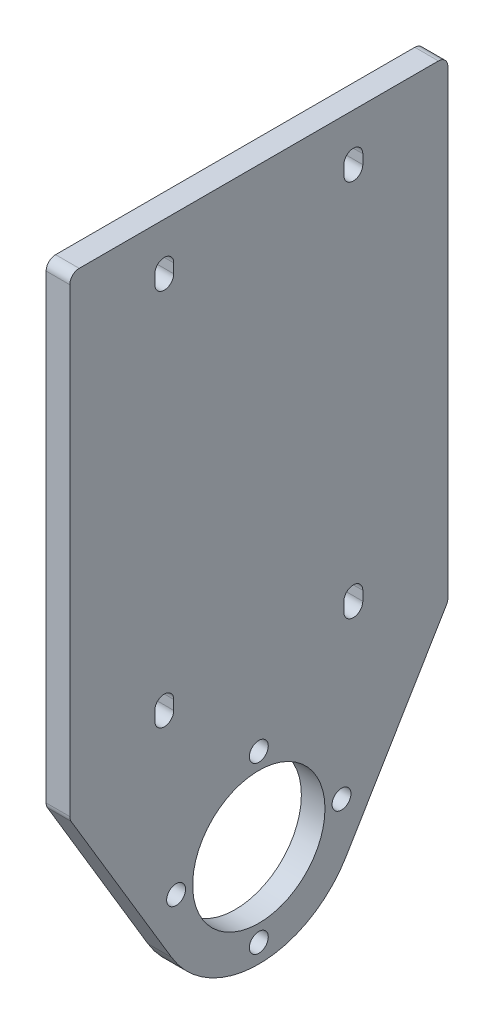
ISO-10303-21;
HEADER;
FILE_DESCRIPTION(('STEP AP214'),'2;1');
FILE_NAME('part.step','',(''),(''),'','','');
FILE_SCHEMA(('AUTOMOTIVE_DESIGN { 1 0 10303 214 1 1 1 1 }'));
ENDSEC;
DATA;
#1=APPLICATION_CONTEXT('core data for automotive mechanical design processes');
#2=APPLICATION_PROTOCOL_DEFINITION('international standard','automotive_design',2000,#1);
#3=PRODUCT_CONTEXT('',#1,'mechanical');
#4=PRODUCT('Part','Part','',(#3));
#5=PRODUCT_RELATED_PRODUCT_CATEGORY('part','',(#4));
#6=PRODUCT_DEFINITION_FORMATION('','',#4);
#7=PRODUCT_DEFINITION_CONTEXT('part definition',#1,'design');
#8=PRODUCT_DEFINITION('design','',#6,#7);
#9=PRODUCT_DEFINITION_SHAPE('','',#8);
#10=(LENGTH_UNIT() NAMED_UNIT(*) SI_UNIT(.MILLI.,.METRE.));
#11=(NAMED_UNIT(*) PLANE_ANGLE_UNIT() SI_UNIT($,.RADIAN.));
#12=(NAMED_UNIT(*) SI_UNIT($,.STERADIAN.) SOLID_ANGLE_UNIT());
#13=UNCERTAINTY_MEASURE_WITH_UNIT(LENGTH_MEASURE(1.E-05),#10,'distance_accuracy_value','');
#14=(GEOMETRIC_REPRESENTATION_CONTEXT(3) GLOBAL_UNCERTAINTY_ASSIGNED_CONTEXT((#13)) GLOBAL_UNIT_ASSIGNED_CONTEXT((#10,
#11,#12)) REPRESENTATION_CONTEXT('',''));
#15=CARTESIAN_POINT('',(0.,0.,0.));
#16=DIRECTION('',(0.,0.,1.));
#17=DIRECTION('',(1.,0.,0.));
#18=AXIS2_PLACEMENT_3D('',#15,#16,#17);
#19=CARTESIAN_POINT('',(5.,0.,21.9999999999999));
#20=DIRECTION('',(0.,0.,1.));
#21=DIRECTION('',(0.,-1.,0.));
#22=AXIS2_PLACEMENT_3D('',#19,#20,#21);
#23=PLANE('',#22);
#24=DIRECTION('',(0.,1.,0.));
#25=VECTOR('',#24,1.);
#26=CARTESIAN_POINT('',(0.,0.,21.9999999999999));
#27=LINE('',#26,#25);
#28=CARTESIAN_POINT('',(0.,-41.,22.));
#29=VERTEX_POINT('',#28);
#30=CARTESIAN_POINT('',(0.,-39.,22.));
#31=VERTEX_POINT('',#30);
#32=EDGE_CURVE('E414',#29,#31,#27,.T.);
#33=ORIENTED_EDGE('',*,*,#32,.T.);
#34=DIRECTION('',(-1.,0.,0.));
#35=VECTOR('',#34,1.);
#36=CARTESIAN_POINT('',(5.,-39.,22.));
#37=LINE('',#36,#35);
#38=CARTESIAN_POINT('',(5.,-39.,22.));
#39=VERTEX_POINT('',#38);
#40=EDGE_CURVE('E447',#39,#31,#37,.T.);
#41=ORIENTED_EDGE('',*,*,#40,.F.);
#42=DIRECTION('',(0.,1.,0.));
#43=VECTOR('',#42,1.);
#44=CARTESIAN_POINT('',(5.,0.,21.9999999999999));
#45=LINE('',#44,#43);
#46=CARTESIAN_POINT('',(5.,-41.,22.));
#47=VERTEX_POINT('',#46);
#48=EDGE_CURVE('E332',#47,#39,#45,.T.);
#49=ORIENTED_EDGE('',*,*,#48,.F.);
#50=DIRECTION('',(-1.,0.,0.));
#51=VECTOR('',#50,1.);
#52=CARTESIAN_POINT('',(5.,-41.,22.));
#53=LINE('',#52,#51);
#54=EDGE_CURVE('E439',#47,#29,#53,.T.);
#55=ORIENTED_EDGE('',*,*,#54,.T.);
#56=EDGE_LOOP('',(#33,#41,#49,#55));
#57=FACE_BOUND('',#56,.T.);
#58=ADVANCED_FACE('F41',(#57),#23,.F.);
#59=CARTESIAN_POINT('',(5.,-39.,20.));
#60=DIRECTION('',(-1.,0.,0.));
#61=DIRECTION('',(0.,0.,1.));
#62=AXIS2_PLACEMENT_3D('',#59,#60,#61);
#63=CYLINDRICAL_SURFACE('',#62,2.);
#64=CARTESIAN_POINT('',(0.,-39.,20.));
#65=DIRECTION('',(1.,0.,0.));
#66=DIRECTION('',(0.,0.,-1.));
#67=AXIS2_PLACEMENT_3D('',#64,#65,#66);
#68=CIRCLE('',#67,2.);
#69=CARTESIAN_POINT('',(0.,-39.,18.));
#70=VERTEX_POINT('',#69);
#71=EDGE_CURVE('E417',#31,#70,#68,.F.);
#72=ORIENTED_EDGE('',*,*,#71,.T.);
#73=DIRECTION('',(-1.,0.,0.));
#74=VECTOR('',#73,1.);
#75=CARTESIAN_POINT('',(5.,-39.,18.));
#76=LINE('',#75,#74);
#77=CARTESIAN_POINT('',(5.,-39.,18.));
#78=VERTEX_POINT('',#77);
#79=EDGE_CURVE('E445',#78,#70,#76,.T.);
#80=ORIENTED_EDGE('',*,*,#79,.F.);
#81=CARTESIAN_POINT('',(5.,-39.,20.));
#82=DIRECTION('',(1.,0.,0.));
#83=DIRECTION('',(0.,0.,-1.));
#84=AXIS2_PLACEMENT_3D('',#81,#82,#83);
#85=CIRCLE('',#84,2.);
#86=EDGE_CURVE('E336',#39,#78,#85,.F.);
#87=ORIENTED_EDGE('',*,*,#86,.F.);
#88=ORIENTED_EDGE('',*,*,#40,.T.);
#89=EDGE_LOOP('',(#72,#80,#87,#88));
#90=FACE_BOUND('',#89,.T.);
#91=ADVANCED_FACE('F554',(#90),#63,.F.);
#92=CARTESIAN_POINT('',(5.,0.,18.));
#93=DIRECTION('',(0.,0.,1.));
#94=DIRECTION('',(1.,0.,0.));
#95=AXIS2_PLACEMENT_3D('',#92,#93,#94);
#96=PLANE('',#95);
#97=DIRECTION('',(0.,1.,0.));
#98=VECTOR('',#97,1.);
#99=CARTESIAN_POINT('',(0.,0.,18.));
#100=LINE('',#99,#98);
#101=CARTESIAN_POINT('',(0.,-41.,18.));
#102=VERTEX_POINT('',#101);
#103=EDGE_CURVE('E420',#102,#70,#100,.T.);
#104=ORIENTED_EDGE('',*,*,#103,.F.);
#105=DIRECTION('',(-1.,0.,0.));
#106=VECTOR('',#105,1.);
#107=CARTESIAN_POINT('',(5.,-41.,18.));
#108=LINE('',#107,#106);
#109=CARTESIAN_POINT('',(5.,-41.,18.));
#110=VERTEX_POINT('',#109);
#111=EDGE_CURVE('E442',#110,#102,#108,.T.);
#112=ORIENTED_EDGE('',*,*,#111,.F.);
#113=DIRECTION('',(0.,1.,0.));
#114=VECTOR('',#113,1.);
#115=CARTESIAN_POINT('',(5.,0.,18.));
#116=LINE('',#115,#114);
#117=EDGE_CURVE('E338',#110,#78,#116,.T.);
#118=ORIENTED_EDGE('',*,*,#117,.T.);
#119=ORIENTED_EDGE('',*,*,#79,.T.);
#120=EDGE_LOOP('',(#104,#112,#118,#119));
#121=FACE_BOUND('',#120,.T.);
#122=ADVANCED_FACE('F560',(#121),#96,.T.);
#123=CARTESIAN_POINT('',(5.,0.,-22.));
#124=DIRECTION('',(0.,0.,-1.));
#125=DIRECTION('',(-1.,0.,0.));
#126=AXIS2_PLACEMENT_3D('',#123,#124,#125);
#127=PLANE('',#126);
#128=DIRECTION('',(0.,-1.,0.));
#129=VECTOR('',#128,1.);
#130=CARTESIAN_POINT('',(0.,0.,-22.));
#131=LINE('',#130,#129);
#132=CARTESIAN_POINT('',(0.,41.,-22.));
#133=VERTEX_POINT('',#132);
#134=CARTESIAN_POINT('',(0.,39.,-22.));
#135=VERTEX_POINT('',#134);
#136=EDGE_CURVE('E403',#133,#135,#131,.T.);
#137=ORIENTED_EDGE('',*,*,#136,.T.);
#138=DIRECTION('',(-1.,0.,0.));
#139=VECTOR('',#138,1.);
#140=CARTESIAN_POINT('',(5.,39.,-22.));
#141=LINE('',#140,#139);
#142=CARTESIAN_POINT('',(5.,39.,-22.));
#143=VERTEX_POINT('',#142);
#144=EDGE_CURVE('E443',#143,#135,#141,.T.);
#145=ORIENTED_EDGE('',*,*,#144,.F.);
#146=DIRECTION('',(0.,-1.,0.));
#147=VECTOR('',#146,1.);
#148=CARTESIAN_POINT('',(5.,0.,-22.));
#149=LINE('',#148,#147);
#150=CARTESIAN_POINT('',(5.,41.,-22.));
#151=VERTEX_POINT('',#150);
#152=EDGE_CURVE('E317',#151,#143,#149,.T.);
#153=ORIENTED_EDGE('',*,*,#152,.F.);
#154=DIRECTION('',(-1.,0.,0.));
#155=VECTOR('',#154,1.);
#156=CARTESIAN_POINT('',(5.,41.,-22.));
#157=LINE('',#156,#155);
#158=EDGE_CURVE('E451',#151,#133,#157,.T.);
#159=ORIENTED_EDGE('',*,*,#158,.T.);
#160=EDGE_LOOP('',(#137,#145,#153,#159));
#161=FACE_BOUND('',#160,.T.);
#162=ADVANCED_FACE('F571',(#161),#127,.F.);
#163=CARTESIAN_POINT('',(5.,39.,-20.));
#164=DIRECTION('',(-1.,0.,0.));
#165=DIRECTION('',(0.,0.,1.));
#166=AXIS2_PLACEMENT_3D('',#163,#164,#165);
#167=CYLINDRICAL_SURFACE('',#166,1.99999999999999);
#168=CARTESIAN_POINT('',(0.,39.,-20.));
#169=DIRECTION('',(1.,0.,0.));
#170=DIRECTION('',(0.,0.,-1.));
#171=AXIS2_PLACEMENT_3D('',#168,#169,#170);
#172=CIRCLE('',#171,1.99999999999999);
#173=CARTESIAN_POINT('',(0.,39.,-18.));
#174=VERTEX_POINT('',#173);
#175=EDGE_CURVE('E406',#135,#174,#172,.F.);
#176=ORIENTED_EDGE('',*,*,#175,.T.);
#177=DIRECTION('',(-1.,0.,0.));
#178=VECTOR('',#177,1.);
#179=CARTESIAN_POINT('',(5.,39.,-18.));
#180=LINE('',#179,#178);
#181=CARTESIAN_POINT('',(5.,39.,-18.));
#182=VERTEX_POINT('',#181);
#183=EDGE_CURVE('E457',#182,#174,#180,.T.);
#184=ORIENTED_EDGE('',*,*,#183,.F.);
#185=CARTESIAN_POINT('',(5.,39.,-20.));
#186=DIRECTION('',(1.,0.,0.));
#187=DIRECTION('',(0.,0.,-1.));
#188=AXIS2_PLACEMENT_3D('',#185,#186,#187);
#189=CIRCLE('',#188,1.99999999999999);
#190=EDGE_CURVE('E321',#143,#182,#189,.F.);
#191=ORIENTED_EDGE('',*,*,#190,.F.);
#192=ORIENTED_EDGE('',*,*,#144,.T.);
#193=EDGE_LOOP('',(#176,#184,#191,#192));
#194=FACE_BOUND('',#193,.T.);
#195=ADVANCED_FACE('F568',(#194),#167,.F.);
#196=CARTESIAN_POINT('',(5.,0.,-18.));
#197=DIRECTION('',(0.,0.,-1.));
#198=DIRECTION('',(-1.,0.,0.));
#199=AXIS2_PLACEMENT_3D('',#196,#197,#198);
#200=PLANE('',#199);
#201=DIRECTION('',(0.,-1.,0.));
#202=VECTOR('',#201,1.);
#203=CARTESIAN_POINT('',(0.,0.,-18.));
#204=LINE('',#203,#202);
#205=CARTESIAN_POINT('',(0.,41.,-18.));
#206=VERTEX_POINT('',#205);
#207=EDGE_CURVE('E409',#206,#174,#204,.T.);
#208=ORIENTED_EDGE('',*,*,#207,.F.);
#209=DIRECTION('',(-1.,0.,0.));
#210=VECTOR('',#209,1.);
#211=CARTESIAN_POINT('',(5.,41.,-18.));
#212=LINE('',#211,#210);
#213=CARTESIAN_POINT('',(5.,41.,-18.));
#214=VERTEX_POINT('',#213);
#215=EDGE_CURVE('E454',#214,#206,#212,.T.);
#216=ORIENTED_EDGE('',*,*,#215,.F.);
#217=DIRECTION('',(0.,-1.,0.));
#218=VECTOR('',#217,1.);
#219=CARTESIAN_POINT('',(5.,0.,-18.));
#220=LINE('',#219,#218);
#221=EDGE_CURVE('E327',#214,#182,#220,.T.);
#222=ORIENTED_EDGE('',*,*,#221,.T.);
#223=ORIENTED_EDGE('',*,*,#183,.T.);
#224=EDGE_LOOP('',(#208,#216,#222,#223));
#225=FACE_BOUND('',#224,.T.);
#226=ADVANCED_FACE('F565',(#225),#200,.T.);
#227=CARTESIAN_POINT('',(5.,0.,-40.));
#228=DIRECTION('',(0.,0.,-1.));
#229=DIRECTION('',(-1.,0.,0.));
#230=AXIS2_PLACEMENT_3D('',#227,#228,#229);
#231=PLANE('',#230);
#232=DIRECTION('',(0.,-1.,0.));
#233=VECTOR('',#232,1.);
#234=CARTESIAN_POINT('',(5.,0.,-40.));
#235=LINE('',#234,#233);
#236=CARTESIAN_POINT('',(5.,48.,-40.));
#237=VERTEX_POINT('',#236);
#238=CARTESIAN_POINT('',(5.,-49.4476384907167,-40.));
#239=VERTEX_POINT('',#238);
#240=EDGE_CURVE('E276',#237,#239,#235,.T.);
#241=ORIENTED_EDGE('',*,*,#240,.T.);
#242=DIRECTION('',(-1.,0.,0.));
#243=VECTOR('',#242,1.);
#244=CARTESIAN_POINT('',(5.,-49.4476384907167,-40.));
#245=LINE('',#244,#243);
#246=CARTESIAN_POINT('',(0.,-49.4476384907167,-40.));
#247=VERTEX_POINT('',#246);
#248=EDGE_CURVE('E478',#239,#247,#245,.T.);
#249=ORIENTED_EDGE('',*,*,#248,.T.);
#250=DIRECTION('',(0.,-1.,0.));
#251=VECTOR('',#250,1.);
#252=CARTESIAN_POINT('',(0.,0.,-40.));
#253=LINE('',#252,#251);
#254=CARTESIAN_POINT('',(0.,48.,-40.));
#255=VERTEX_POINT('',#254);
#256=EDGE_CURVE('E388',#255,#247,#253,.T.);
#257=ORIENTED_EDGE('',*,*,#256,.F.);
#258=DIRECTION('',(-1.,0.,0.));
#259=VECTOR('',#258,1.);
#260=CARTESIAN_POINT('',(5.,48.,-40.));
#261=LINE('',#260,#259);
#262=EDGE_CURVE('E450',#255,#237,#261,.F.);
#263=ORIENTED_EDGE('',*,*,#262,.T.);
#264=EDGE_LOOP('',(#241,#249,#257,#263));
#265=FACE_BOUND('',#264,.T.);
#266=ADVANCED_FACE('F534',(#265),#231,.T.);
#267=CARTESIAN_POINT('',(5.,50.,0.));
#268=DIRECTION('',(0.,1.,0.));
#269=DIRECTION('',(0.,0.,1.));
#270=AXIS2_PLACEMENT_3D('',#267,#268,#269);
#271=PLANE('',#270);
#272=DIRECTION('',(0.,0.,-1.));
#273=VECTOR('',#272,1.);
#274=CARTESIAN_POINT('',(5.,50.,0.));
#275=LINE('',#274,#273);
#276=CARTESIAN_POINT('',(5.,50.,38.));
#277=VERTEX_POINT('',#276);
#278=CARTESIAN_POINT('',(5.,50.,-38.));
#279=VERTEX_POINT('',#278);
#280=EDGE_CURVE('E280',#277,#279,#275,.T.);
#281=ORIENTED_EDGE('',*,*,#280,.T.);
#282=DIRECTION('',(-1.,0.,0.));
#283=VECTOR('',#282,1.);
#284=CARTESIAN_POINT('',(5.,50.,-38.));
#285=LINE('',#284,#283);
#286=CARTESIAN_POINT('',(0.,50.,-38.));
#287=VERTEX_POINT('',#286);
#288=EDGE_CURVE('E12',#279,#287,#285,.T.);
#289=ORIENTED_EDGE('',*,*,#288,.T.);
#290=DIRECTION('',(0.,0.,-1.));
#291=VECTOR('',#290,1.);
#292=CARTESIAN_POINT('',(0.,50.,0.));
#293=LINE('',#292,#291);
#294=CARTESIAN_POINT('',(0.,50.,38.));
#295=VERTEX_POINT('',#294);
#296=EDGE_CURVE('E391',#295,#287,#293,.T.);
#297=ORIENTED_EDGE('',*,*,#296,.F.);
#298=DIRECTION('',(-1.,0.,0.));
#299=VECTOR('',#298,1.);
#300=CARTESIAN_POINT('',(5.,50.,38.));
#301=LINE('',#300,#299);
#302=EDGE_CURVE('E49',#295,#277,#301,.F.);
#303=ORIENTED_EDGE('',*,*,#302,.T.);
#304=EDGE_LOOP('',(#281,#289,#297,#303));
#305=FACE_BOUND('',#304,.T.);
#306=ADVANCED_FACE('F510',(#305),#271,.T.);
#307=CARTESIAN_POINT('',(5.,0.,40.));
#308=DIRECTION('',(0.,0.,-1.));
#309=DIRECTION('',(-1.,0.,0.));
#310=AXIS2_PLACEMENT_3D('',#307,#308,#309);
#311=PLANE('',#310);
#312=DIRECTION('',(0.,-1.,0.));
#313=VECTOR('',#312,1.);
#314=CARTESIAN_POINT('',(0.,0.,40.));
#315=LINE('',#314,#313);
#316=CARTESIAN_POINT('',(0.,48.,40.));
#317=VERTEX_POINT('',#316);
#318=CARTESIAN_POINT('',(0.,-49.4476384907167,40.));
#319=VERTEX_POINT('',#318);
#320=EDGE_CURVE('E394',#317,#319,#315,.T.);
#321=ORIENTED_EDGE('',*,*,#320,.T.);
#322=DIRECTION('',(-1.,0.,0.));
#323=VECTOR('',#322,1.);
#324=CARTESIAN_POINT('',(5.,-49.4476384907167,40.));
#325=LINE('',#324,#323);
#326=CARTESIAN_POINT('',(5.,-49.4476384907167,40.));
#327=VERTEX_POINT('',#326);
#328=EDGE_CURVE('E64',#319,#327,#325,.F.);
#329=ORIENTED_EDGE('',*,*,#328,.T.);
#330=DIRECTION('',(0.,-1.,0.));
#331=VECTOR('',#330,1.);
#332=CARTESIAN_POINT('',(5.,0.,40.));
#333=LINE('',#332,#331);
#334=CARTESIAN_POINT('',(5.,48.,40.));
#335=VERTEX_POINT('',#334);
#336=EDGE_CURVE('E310',#335,#327,#333,.T.);
#337=ORIENTED_EDGE('',*,*,#336,.F.);
#338=DIRECTION('',(-1.,0.,0.));
#339=VECTOR('',#338,1.);
#340=CARTESIAN_POINT('',(0.,48.,40.));
#341=LINE('',#340,#339);
#342=EDGE_CURVE('E502',#335,#317,#341,.T.);
#343=ORIENTED_EDGE('',*,*,#342,.T.);
#344=EDGE_LOOP('',(#321,#329,#337,#343));
#345=FACE_BOUND('',#344,.T.);
#346=ADVANCED_FACE('F501',(#345),#311,.F.);
#347=CARTESIAN_POINT('',(5.,-30.7884019346406,51.4880041133612));
#348=DIRECTION('',(0.,0.513215575918409,-0.858259734949005));
#349=DIRECTION('',(0.,0.858259734949005,0.513215575918409));
#350=AXIS2_PLACEMENT_3D('',#347,#348,#349);
#351=PLANE('',#350);
#352=DIRECTION('',(0.,-0.858259734949005,-0.513215575918409));
#353=VECTOR('',#352,1.);
#354=CARTESIAN_POINT('',(5.,-30.7884019346406,51.4880041133612));
#355=LINE('',#354,#353);
#356=CARTESIAN_POINT('',(5.,-50.4740696425535,39.716519469898));
#357=VERTEX_POINT('',#356);
#358=CARTESIAN_POINT('',(5.,-86.0341348822458,18.4525843014036));
#359=VERTEX_POINT('',#358);
#360=EDGE_CURVE('E307',#357,#359,#355,.T.);
#361=ORIENTED_EDGE('',*,*,#360,.F.);
#362=DIRECTION('',(-1.,0.,0.));
#363=VECTOR('',#362,1.);
#364=CARTESIAN_POINT('',(5.,-50.4740696425535,39.716519469898));
#365=LINE('',#364,#363);
#366=CARTESIAN_POINT('',(0.,-50.4740696425535,39.716519469898));
#367=VERTEX_POINT('',#366);
#368=EDGE_CURVE('E504',#357,#367,#365,.T.);
#369=ORIENTED_EDGE('',*,*,#368,.T.);
#370=DIRECTION('',(0.,-0.858259734949005,-0.513215575918409));
#371=VECTOR('',#370,1.);
#372=CARTESIAN_POINT('',(0.,-30.7884019346406,51.4880041133612));
#373=LINE('',#372,#371);
#374=CARTESIAN_POINT('',(0.,-86.0341348822458,18.4525843014036));
#375=VERTEX_POINT('',#374);
#376=EDGE_CURVE('E396',#367,#375,#373,.T.);
#377=ORIENTED_EDGE('',*,*,#376,.T.);
#378=DIRECTION('',(-1.,0.,0.));
#379=VECTOR('',#378,1.);
#380=CARTESIAN_POINT('',(5.,-86.0341348822458,18.4525843014036));
#381=LINE('',#380,#379);
#382=EDGE_CURVE('E455',#359,#375,#381,.T.);
#383=ORIENTED_EDGE('',*,*,#382,.F.);
#384=EDGE_LOOP('',(#361,#369,#377,#383));
#385=FACE_BOUND('',#384,.T.);
#386=ADVANCED_FACE('F521',(#385),#351,.F.);
#387=CARTESIAN_POINT('',(5.,-75.,0.));
#388=DIRECTION('',(-1.,0.,0.));
#389=DIRECTION('',(0.,0.,1.));
#390=AXIS2_PLACEMENT_3D('',#387,#388,#389);
#391=CYLINDRICAL_SURFACE('',#390,21.5);
#392=CARTESIAN_POINT('',(0.,-75.,0.));
#393=DIRECTION('',(1.,0.,0.));
#394=DIRECTION('',(0.,0.,-1.));
#395=AXIS2_PLACEMENT_3D('',#392,#393,#394);
#396=CIRCLE('',#395,21.5);
#397=CARTESIAN_POINT('',(0.,-86.0341348822457,-18.4525843014036));
#398=VERTEX_POINT('',#397);
#399=EDGE_CURVE('E398',#375,#398,#396,.T.);
#400=ORIENTED_EDGE('',*,*,#399,.T.);
#401=DIRECTION('',(-1.,0.,0.));
#402=VECTOR('',#401,1.);
#403=CARTESIAN_POINT('',(5.,-86.0341348822457,-18.4525843014036));
#404=LINE('',#403,#402);
#405=CARTESIAN_POINT('',(5.,-86.0341348822457,-18.4525843014036));
#406=VERTEX_POINT('',#405);
#407=EDGE_CURVE('E461',#406,#398,#404,.T.);
#408=ORIENTED_EDGE('',*,*,#407,.F.);
#409=CARTESIAN_POINT('',(5.,-75.,0.));
#410=DIRECTION('',(1.,0.,0.));
#411=DIRECTION('',(0.,0.,-1.));
#412=AXIS2_PLACEMENT_3D('',#409,#410,#411);
#413=CIRCLE('',#412,21.5);
#414=EDGE_CURVE('E309',#359,#406,#413,.T.);
#415=ORIENTED_EDGE('',*,*,#414,.F.);
#416=ORIENTED_EDGE('',*,*,#382,.T.);
#417=EDGE_LOOP('',(#400,#408,#415,#416));
#418=FACE_BOUND('',#417,.T.);
#419=ADVANCED_FACE('F527',(#418),#391,.T.);
#420=CARTESIAN_POINT('',(5.,39.,20.));
#421=DIRECTION('',(-1.,0.,0.));
#422=DIRECTION('',(0.,0.,1.));
#423=AXIS2_PLACEMENT_3D('',#420,#421,#422);
#424=CYLINDRICAL_SURFACE('',#423,1.99999999999999);
#425=CARTESIAN_POINT('',(0.,39.,20.));
#426=DIRECTION('',(1.,0.,0.));
#427=DIRECTION('',(0.,0.,-1.));
#428=AXIS2_PLACEMENT_3D('',#425,#426,#427);
#429=CIRCLE('',#428,1.99999999999999);
#430=CARTESIAN_POINT('',(0.,39.,22.));
#431=VERTEX_POINT('',#430);
#432=CARTESIAN_POINT('',(0.,39.,18.));
#433=VERTEX_POINT('',#432);
#434=EDGE_CURVE('E376',#431,#433,#429,.T.);
#435=ORIENTED_EDGE('',*,*,#434,.F.);
#436=DIRECTION('',(-1.,0.,0.));
#437=VECTOR('',#436,1.);
#438=CARTESIAN_POINT('',(5.,39.,22.));
#439=LINE('',#438,#437);
#440=CARTESIAN_POINT('',(5.,39.,22.));
#441=VERTEX_POINT('',#440);
#442=EDGE_CURVE('E464',#441,#431,#439,.T.);
#443=ORIENTED_EDGE('',*,*,#442,.F.);
#444=CARTESIAN_POINT('',(5.,39.,20.));
#445=DIRECTION('',(1.,0.,0.));
#446=DIRECTION('',(0.,0.,-1.));
#447=AXIS2_PLACEMENT_3D('',#444,#445,#446);
#448=CIRCLE('',#447,1.99999999999999);
#449=CARTESIAN_POINT('',(5.,39.,18.));
#450=VERTEX_POINT('',#449);
#451=EDGE_CURVE('E257',#441,#450,#448,.T.);
#452=ORIENTED_EDGE('',*,*,#451,.T.);
#453=DIRECTION('',(-1.,0.,0.));
#454=VECTOR('',#453,1.);
#455=CARTESIAN_POINT('',(5.,39.,18.));
#456=LINE('',#455,#454);
#457=EDGE_CURVE('E226',#450,#433,#456,.T.);
#458=ORIENTED_EDGE('',*,*,#457,.T.);
#459=EDGE_LOOP('',(#435,#443,#452,#458));
#460=FACE_BOUND('',#459,.T.);
#461=ADVANCED_FACE('F784',(#460),#424,.F.);
#462=CARTESIAN_POINT('',(5.,0.,22.));
#463=DIRECTION('',(0.,0.,-1.));
#464=DIRECTION('',(-1.,0.,0.));
#465=AXIS2_PLACEMENT_3D('',#462,#463,#464);
#466=PLANE('',#465);
#467=DIRECTION('',(0.,-1.,0.));
#468=VECTOR('',#467,1.);
#469=CARTESIAN_POINT('',(0.,0.,22.));
#470=LINE('',#469,#468);
#471=CARTESIAN_POINT('',(0.,41.,22.));
#472=VERTEX_POINT('',#471);
#473=EDGE_CURVE('E379',#472,#431,#470,.T.);
#474=ORIENTED_EDGE('',*,*,#473,.F.);
#475=DIRECTION('',(-1.,0.,0.));
#476=VECTOR('',#475,1.);
#477=CARTESIAN_POINT('',(5.,41.,22.));
#478=LINE('',#477,#476);
#479=CARTESIAN_POINT('',(5.,41.,22.));
#480=VERTEX_POINT('',#479);
#481=EDGE_CURVE('E470',#480,#472,#478,.T.);
#482=ORIENTED_EDGE('',*,*,#481,.F.);
#483=DIRECTION('',(0.,-1.,0.));
#484=VECTOR('',#483,1.);
#485=CARTESIAN_POINT('',(5.,0.,22.));
#486=LINE('',#485,#484);
#487=EDGE_CURVE('E261',#480,#441,#486,.T.);
#488=ORIENTED_EDGE('',*,*,#487,.T.);
#489=ORIENTED_EDGE('',*,*,#442,.T.);
#490=EDGE_LOOP('',(#474,#482,#488,#489));
#491=FACE_BOUND('',#490,.T.);
#492=ADVANCED_FACE('F787',(#491),#466,.T.);
#493=CARTESIAN_POINT('',(5.,41.,20.));
#494=DIRECTION('',(-1.,0.,0.));
#495=DIRECTION('',(0.,0.,1.));
#496=AXIS2_PLACEMENT_3D('',#493,#494,#495);
#497=CYLINDRICAL_SURFACE('',#496,1.99999999999999);
#498=CARTESIAN_POINT('',(0.,41.,20.));
#499=DIRECTION('',(1.,0.,0.));
#500=DIRECTION('',(0.,0.,-1.));
#501=AXIS2_PLACEMENT_3D('',#498,#499,#500);
#502=CIRCLE('',#501,1.99999999999999);
#503=CARTESIAN_POINT('',(0.,41.,18.));
#504=VERTEX_POINT('',#503);
#505=EDGE_CURVE('E382',#504,#472,#502,.T.);
#506=ORIENTED_EDGE('',*,*,#505,.F.);
#507=DIRECTION('',(-1.,0.,0.));
#508=VECTOR('',#507,1.);
#509=CARTESIAN_POINT('',(5.,41.,18.));
#510=LINE('',#509,#508);
#511=CARTESIAN_POINT('',(5.,41.,18.));
#512=VERTEX_POINT('',#511);
#513=EDGE_CURVE('E468',#512,#504,#510,.T.);
#514=ORIENTED_EDGE('',*,*,#513,.F.);
#515=CARTESIAN_POINT('',(5.,41.,20.));
#516=DIRECTION('',(1.,0.,0.));
#517=DIRECTION('',(0.,0.,-1.));
#518=AXIS2_PLACEMENT_3D('',#515,#516,#517);
#519=CIRCLE('',#518,1.99999999999999);
#520=EDGE_CURVE('E265',#512,#480,#519,.T.);
#521=ORIENTED_EDGE('',*,*,#520,.T.);
#522=ORIENTED_EDGE('',*,*,#481,.T.);
#523=EDGE_LOOP('',(#506,#514,#521,#522));
#524=FACE_BOUND('',#523,.T.);
#525=ADVANCED_FACE('F778',(#524),#497,.F.);
#526=CARTESIAN_POINT('',(5.,-39.,-20.));
#527=DIRECTION('',(-1.,0.,0.));
#528=DIRECTION('',(0.,0.,1.));
#529=AXIS2_PLACEMENT_3D('',#526,#527,#528);
#530=CYLINDRICAL_SURFACE('',#529,2.);
#531=CARTESIAN_POINT('',(0.,-39.,-20.));
#532=DIRECTION('',(1.,0.,0.));
#533=DIRECTION('',(0.,0.,-1.));
#534=AXIS2_PLACEMENT_3D('',#531,#532,#533);
#535=CIRCLE('',#534,2.);
#536=CARTESIAN_POINT('',(0.,-39.,-22.));
#537=VERTEX_POINT('',#536);
#538=CARTESIAN_POINT('',(0.,-39.,-18.));
#539=VERTEX_POINT('',#538);
#540=EDGE_CURVE('E221',#537,#539,#535,.T.);
#541=ORIENTED_EDGE('',*,*,#540,.F.);
#542=DIRECTION('',(-1.,0.,0.));
#543=VECTOR('',#542,1.);
#544=CARTESIAN_POINT('',(5.,-39.,-22.));
#545=LINE('',#544,#543);
#546=CARTESIAN_POINT('',(5.,-39.,-22.));
#547=VERTEX_POINT('',#546);
#548=EDGE_CURVE('E216',#547,#537,#545,.T.);
#549=ORIENTED_EDGE('',*,*,#548,.F.);
#550=CARTESIAN_POINT('',(5.,-39.,-20.));
#551=DIRECTION('',(1.,0.,0.));
#552=DIRECTION('',(0.,0.,-1.));
#553=AXIS2_PLACEMENT_3D('',#550,#551,#552);
#554=CIRCLE('',#553,2.);
#555=CARTESIAN_POINT('',(5.,-39.,-18.));
#556=VERTEX_POINT('',#555);
#557=EDGE_CURVE('E219',#547,#556,#554,.T.);
#558=ORIENTED_EDGE('',*,*,#557,.T.);
#559=DIRECTION('',(-1.,0.,0.));
#560=VECTOR('',#559,1.);
#561=CARTESIAN_POINT('',(5.,-39.,-18.));
#562=LINE('',#561,#560);
#563=EDGE_CURVE('E366',#556,#539,#562,.T.);
#564=ORIENTED_EDGE('',*,*,#563,.T.);
#565=EDGE_LOOP('',(#541,#549,#558,#564));
#566=FACE_BOUND('',#565,.T.);
#567=ADVANCED_FACE('F218',(#566),#530,.F.);
#568=CARTESIAN_POINT('',(5.,0.,-21.9999999999999));
#569=DIRECTION('',(0.,0.,1.));
#570=DIRECTION('',(0.,-1.,0.));
#571=AXIS2_PLACEMENT_3D('',#568,#569,#570);
#572=PLANE('',#571);
#573=DIRECTION('',(0.,1.,0.));
#574=VECTOR('',#573,1.);
#575=CARTESIAN_POINT('',(0.,0.,-21.9999999999999));
#576=LINE('',#575,#574);
#577=CARTESIAN_POINT('',(0.,-41.,-22.));
#578=VERTEX_POINT('',#577);
#579=EDGE_CURVE('E368',#578,#537,#576,.T.);
#580=ORIENTED_EDGE('',*,*,#579,.F.);
#581=DIRECTION('',(-1.,0.,0.));
#582=VECTOR('',#581,1.);
#583=CARTESIAN_POINT('',(5.,-41.,-22.));
#584=LINE('',#583,#582);
#585=CARTESIAN_POINT('',(5.,-41.,-22.));
#586=VERTEX_POINT('',#585);
#587=EDGE_CURVE('E227',#586,#578,#584,.T.);
#588=ORIENTED_EDGE('',*,*,#587,.F.);
#589=DIRECTION('',(0.,1.,0.));
#590=VECTOR('',#589,1.);
#591=CARTESIAN_POINT('',(5.,0.,-21.9999999999999));
#592=LINE('',#591,#590);
#593=EDGE_CURVE('E234',#586,#547,#592,.T.);
#594=ORIENTED_EDGE('',*,*,#593,.T.);
#595=ORIENTED_EDGE('',*,*,#548,.T.);
#596=EDGE_LOOP('',(#580,#588,#594,#595));
#597=FACE_BOUND('',#596,.T.);
#598=ADVANCED_FACE('F241',(#597),#572,.T.);
#599=CARTESIAN_POINT('',(5.,-41.,-20.));
#600=DIRECTION('',(-1.,0.,0.));
#601=DIRECTION('',(0.,0.,1.));
#602=AXIS2_PLACEMENT_3D('',#599,#600,#601);
#603=CYLINDRICAL_SURFACE('',#602,2.00000000000001);
#604=CARTESIAN_POINT('',(0.,-41.,-20.));
#605=DIRECTION('',(1.,0.,0.));
#606=DIRECTION('',(0.,0.,-1.));
#607=AXIS2_PLACEMENT_3D('',#604,#605,#606);
#608=CIRCLE('',#607,2.00000000000001);
#609=CARTESIAN_POINT('',(0.,-41.,-18.));
#610=VERTEX_POINT('',#609);
#611=EDGE_CURVE('E370',#610,#578,#608,.T.);
#612=ORIENTED_EDGE('',*,*,#611,.F.);
#613=DIRECTION('',(-1.,0.,0.));
#614=VECTOR('',#613,1.);
#615=CARTESIAN_POINT('',(5.,-41.,-18.));
#616=LINE('',#615,#614);
#617=CARTESIAN_POINT('',(5.,-41.,-18.));
#618=VERTEX_POINT('',#617);
#619=EDGE_CURVE('E474',#618,#610,#616,.T.);
#620=ORIENTED_EDGE('',*,*,#619,.F.);
#621=CARTESIAN_POINT('',(5.,-41.,-20.));
#622=DIRECTION('',(1.,0.,0.));
#623=DIRECTION('',(0.,0.,-1.));
#624=AXIS2_PLACEMENT_3D('',#621,#622,#623);
#625=CIRCLE('',#624,2.00000000000001);
#626=EDGE_CURVE('E242',#618,#586,#625,.T.);
#627=ORIENTED_EDGE('',*,*,#626,.T.);
#628=ORIENTED_EDGE('',*,*,#587,.T.);
#629=EDGE_LOOP('',(#612,#620,#627,#628));
#630=FACE_BOUND('',#629,.T.);
#631=ADVANCED_FACE('F624',(#630),#603,.F.);
#632=CARTESIAN_POINT('',(5.,-75.,17.5));
#633=DIRECTION('',(-1.,0.,0.));
#634=DIRECTION('',(0.,0.,1.));
#635=AXIS2_PLACEMENT_3D('',#632,#633,#634);
#636=CYLINDRICAL_SURFACE('',#635,2.);
#637=CARTESIAN_POINT('',(5.,-75.,17.5));
#638=DIRECTION('',(1.,0.,0.));
#639=DIRECTION('',(0.,0.,-1.));
#640=AXIS2_PLACEMENT_3D('',#637,#638,#639);
#641=CIRCLE('',#640,2.);
#642=CARTESIAN_POINT('',(5.,-75.,15.5));
#643=VERTEX_POINT('',#642);
#644=EDGE_CURVE('E359',#643,#643,#641,.T.);
#645=ORIENTED_EDGE('',*,*,#644,.T.);
#646=EDGE_LOOP('',(#645));
#647=FACE_BOUND('',#646,.T.);
#648=CARTESIAN_POINT('',(0.,-75.,17.5));
#649=DIRECTION('',(1.,0.,0.));
#650=DIRECTION('',(0.,0.,-1.));
#651=AXIS2_PLACEMENT_3D('',#648,#649,#650);
#652=CIRCLE('',#651,2.);
#653=CARTESIAN_POINT('',(0.,-75.,15.5));
#654=VERTEX_POINT('',#653);
#655=EDGE_CURVE('E434',#654,#654,#652,.T.);
#656=ORIENTED_EDGE('',*,*,#655,.F.);
#657=EDGE_LOOP('',(#656));
#658=FACE_BOUND('',#657,.T.);
#659=ADVANCED_FACE('F620',(#647,#658),#636,.F.);
#660=CARTESIAN_POINT('',(5.,-92.5,0.));
#661=DIRECTION('',(-1.,0.,0.));
#662=DIRECTION('',(0.,0.,1.));
#663=AXIS2_PLACEMENT_3D('',#660,#661,#662);
#664=CYLINDRICAL_SURFACE('',#663,2.00000000000001);
#665=CARTESIAN_POINT('',(5.,-92.5,0.));
#666=DIRECTION('',(1.,0.,0.));
#667=DIRECTION('',(0.,0.,-1.));
#668=AXIS2_PLACEMENT_3D('',#665,#666,#667);
#669=CIRCLE('',#668,2.00000000000001);
#670=CARTESIAN_POINT('',(5.,-92.5,-2.00000000000001));
#671=VERTEX_POINT('',#670);
#672=EDGE_CURVE('E355',#671,#671,#669,.T.);
#673=ORIENTED_EDGE('',*,*,#672,.T.);
#674=EDGE_LOOP('',(#673));
#675=FACE_BOUND('',#674,.T.);
#676=CARTESIAN_POINT('',(0.,-92.5,0.));
#677=DIRECTION('',(1.,0.,0.));
#678=DIRECTION('',(0.,0.,-1.));
#679=AXIS2_PLACEMENT_3D('',#676,#677,#678);
#680=CIRCLE('',#679,2.00000000000001);
#681=CARTESIAN_POINT('',(0.,-92.5,-2.00000000000001));
#682=VERTEX_POINT('',#681);
#683=EDGE_CURVE('E431',#682,#682,#680,.T.);
#684=ORIENTED_EDGE('',*,*,#683,.F.);
#685=EDGE_LOOP('',(#684));
#686=FACE_BOUND('',#685,.T.);
#687=ADVANCED_FACE('F623',(#675,#686),#664,.F.);
#688=CARTESIAN_POINT('',(5.,-75.,-17.5));
#689=DIRECTION('',(-1.,0.,0.));
#690=DIRECTION('',(0.,0.,1.));
#691=AXIS2_PLACEMENT_3D('',#688,#689,#690);
#692=CYLINDRICAL_SURFACE('',#691,2.00000000000001);
#693=CARTESIAN_POINT('',(5.,-75.,-17.5));
#694=DIRECTION('',(1.,0.,0.));
#695=DIRECTION('',(0.,0.,-1.));
#696=AXIS2_PLACEMENT_3D('',#693,#694,#695);
#697=CIRCLE('',#696,2.00000000000001);
#698=CARTESIAN_POINT('',(5.,-75.,-19.5));
#699=VERTEX_POINT('',#698);
#700=EDGE_CURVE('E351',#699,#699,#697,.T.);
#701=ORIENTED_EDGE('',*,*,#700,.T.);
#702=EDGE_LOOP('',(#701));
#703=FACE_BOUND('',#702,.T.);
#704=CARTESIAN_POINT('',(0.,-75.,-17.5));
#705=DIRECTION('',(1.,0.,0.));
#706=DIRECTION('',(0.,0.,-1.));
#707=AXIS2_PLACEMENT_3D('',#704,#705,#706);
#708=CIRCLE('',#707,2.00000000000001);
#709=CARTESIAN_POINT('',(0.,-75.,-19.5));
#710=VERTEX_POINT('',#709);
#711=EDGE_CURVE('E428',#710,#710,#708,.T.);
#712=ORIENTED_EDGE('',*,*,#711,.F.);
#713=EDGE_LOOP('',(#712));
#714=FACE_BOUND('',#713,.T.);
#715=ADVANCED_FACE('F628',(#703,#714),#692,.F.);
#716=CARTESIAN_POINT('',(5.,-75.,0.));
#717=DIRECTION('',(-1.,0.,0.));
#718=DIRECTION('',(0.,0.,1.));
#719=AXIS2_PLACEMENT_3D('',#716,#717,#718);
#720=CYLINDRICAL_SURFACE('',#719,14.);
#721=CARTESIAN_POINT('',(5.,-75.,0.));
#722=DIRECTION('',(1.,0.,0.));
#723=DIRECTION('',(0.,0.,-1.));
#724=AXIS2_PLACEMENT_3D('',#721,#722,#723);
#725=CIRCLE('',#724,14.);
#726=CARTESIAN_POINT('',(5.,-75.,-14.));
#727=VERTEX_POINT('',#726);
#728=EDGE_CURVE('E348',#727,#727,#725,.T.);
#729=ORIENTED_EDGE('',*,*,#728,.T.);
#730=EDGE_LOOP('',(#729));
#731=FACE_BOUND('',#730,.T.);
#732=CARTESIAN_POINT('',(0.,-75.,0.));
#733=DIRECTION('',(1.,0.,0.));
#734=DIRECTION('',(0.,0.,-1.));
#735=AXIS2_PLACEMENT_3D('',#732,#733,#734);
#736=CIRCLE('',#735,14.);
#737=CARTESIAN_POINT('',(0.,-75.,-14.));
#738=VERTEX_POINT('',#737);
#739=EDGE_CURVE('E425',#738,#738,#736,.T.);
#740=ORIENTED_EDGE('',*,*,#739,.F.);
#741=EDGE_LOOP('',(#740));
#742=FACE_BOUND('',#741,.T.);
#743=ADVANCED_FACE('F632',(#731,#742),#720,.F.);
#744=CARTESIAN_POINT('',(5.,-41.,20.));
#745=DIRECTION('',(-1.,0.,0.));
#746=DIRECTION('',(0.,0.,1.));
#747=AXIS2_PLACEMENT_3D('',#744,#745,#746);
#748=CYLINDRICAL_SURFACE('',#747,2.00000000000001);
#749=CARTESIAN_POINT('',(0.,-41.,20.));
#750=DIRECTION('',(1.,0.,0.));
#751=DIRECTION('',(0.,0.,-1.));
#752=AXIS2_PLACEMENT_3D('',#749,#750,#751);
#753=CIRCLE('',#752,2.00000000000001);
#754=EDGE_CURVE('E423',#102,#29,#753,.F.);
#755=ORIENTED_EDGE('',*,*,#754,.T.);
#756=ORIENTED_EDGE('',*,*,#54,.F.);
#757=CARTESIAN_POINT('',(5.,-41.,20.));
#758=DIRECTION('',(1.,0.,0.));
#759=DIRECTION('',(0.,0.,-1.));
#760=AXIS2_PLACEMENT_3D('',#757,#758,#759);
#761=CIRCLE('',#760,2.00000000000001);
#762=EDGE_CURVE('E342',#110,#47,#761,.F.);
#763=ORIENTED_EDGE('',*,*,#762,.F.);
#764=ORIENTED_EDGE('',*,*,#111,.T.);
#765=EDGE_LOOP('',(#755,#756,#763,#764));
#766=FACE_BOUND('',#765,.T.);
#767=ADVANCED_FACE('F548',(#766),#748,.F.);
#768=CARTESIAN_POINT('',(5.,41.,-20.));
#769=DIRECTION('',(-1.,0.,0.));
#770=DIRECTION('',(0.,0.,1.));
#771=AXIS2_PLACEMENT_3D('',#768,#769,#770);
#772=CYLINDRICAL_SURFACE('',#771,1.99999999999999);
#773=CARTESIAN_POINT('',(0.,41.,-20.));
#774=DIRECTION('',(1.,0.,0.));
#775=DIRECTION('',(0.,0.,-1.));
#776=AXIS2_PLACEMENT_3D('',#773,#774,#775);
#777=CIRCLE('',#776,1.99999999999999);
#778=EDGE_CURVE('E412',#206,#133,#777,.F.);
#779=ORIENTED_EDGE('',*,*,#778,.T.);
#780=ORIENTED_EDGE('',*,*,#158,.F.);
#781=CARTESIAN_POINT('',(5.,41.,-20.));
#782=DIRECTION('',(1.,0.,0.));
#783=DIRECTION('',(0.,0.,-1.));
#784=AXIS2_PLACEMENT_3D('',#781,#782,#783);
#785=CIRCLE('',#784,1.99999999999999);
#786=EDGE_CURVE('E331',#214,#151,#785,.F.);
#787=ORIENTED_EDGE('',*,*,#786,.F.);
#788=ORIENTED_EDGE('',*,*,#215,.T.);
#789=EDGE_LOOP('',(#779,#780,#787,#788));
#790=FACE_BOUND('',#789,.T.);
#791=ADVANCED_FACE('F539',(#790),#772,.F.);
#792=CARTESIAN_POINT('',(5.,-30.7884019346406,-51.4880041133612));
#793=DIRECTION('',(0.,-0.513215575918409,-0.858259734949005));
#794=DIRECTION('',(0.,0.858259734949005,-0.513215575918409));
#795=AXIS2_PLACEMENT_3D('',#792,#793,#794);
#796=PLANE('',#795);
#797=DIRECTION('',(0.,-0.858259734949005,0.513215575918409));
#798=VECTOR('',#797,1.);
#799=CARTESIAN_POINT('',(0.,-30.7884019346406,-51.4880041133612));
#800=LINE('',#799,#798);
#801=CARTESIAN_POINT('',(0.,-50.4740696425535,-39.716519469898));
#802=VERTEX_POINT('',#801);
#803=EDGE_CURVE('E401',#802,#398,#800,.T.);
#804=ORIENTED_EDGE('',*,*,#803,.F.);
#805=DIRECTION('',(-1.,0.,0.));
#806=VECTOR('',#805,1.);
#807=CARTESIAN_POINT('',(5.,-50.4740696425535,-39.716519469898));
#808=LINE('',#807,#806);
#809=CARTESIAN_POINT('',(5.,-50.4740696425535,-39.716519469898));
#810=VERTEX_POINT('',#809);
#811=EDGE_CURVE('E488',#802,#810,#808,.F.);
#812=ORIENTED_EDGE('',*,*,#811,.T.);
#813=DIRECTION('',(0.,-0.858259734949005,0.513215575918409));
#814=VECTOR('',#813,1.);
#815=CARTESIAN_POINT('',(5.,-30.7884019346406,-51.4880041133612));
#816=LINE('',#815,#814);
#817=EDGE_CURVE('E314',#810,#406,#816,.T.);
#818=ORIENTED_EDGE('',*,*,#817,.T.);
#819=ORIENTED_EDGE('',*,*,#407,.T.);
#820=EDGE_LOOP('',(#804,#812,#818,#819));
#821=FACE_BOUND('',#820,.T.);
#822=ADVANCED_FACE('F536',(#821),#796,.T.);
#823=CARTESIAN_POINT('',(5.,0.,18.));
#824=DIRECTION('',(0.,0.,-1.));
#825=DIRECTION('',(-1.,0.,0.));
#826=AXIS2_PLACEMENT_3D('',#823,#824,#825);
#827=PLANE('',#826);
#828=DIRECTION('',(0.,-1.,0.));
#829=VECTOR('',#828,1.);
#830=CARTESIAN_POINT('',(0.,0.,18.));
#831=LINE('',#830,#829);
#832=EDGE_CURVE('E385',#504,#433,#831,.T.);
#833=ORIENTED_EDGE('',*,*,#832,.T.);
#834=ORIENTED_EDGE('',*,*,#457,.F.);
#835=DIRECTION('',(0.,-1.,0.));
#836=VECTOR('',#835,1.);
#837=CARTESIAN_POINT('',(5.,0.,18.));
#838=LINE('',#837,#836);
#839=EDGE_CURVE('E273',#512,#450,#838,.T.);
#840=ORIENTED_EDGE('',*,*,#839,.F.);
#841=ORIENTED_EDGE('',*,*,#513,.T.);
#842=EDGE_LOOP('',(#833,#834,#840,#841));
#843=FACE_BOUND('',#842,.T.);
#844=ADVANCED_FACE('F538',(#843),#827,.F.);
#845=CARTESIAN_POINT('',(5.,0.,-18.));
#846=DIRECTION('',(0.,0.,1.));
#847=DIRECTION('',(1.,0.,0.));
#848=AXIS2_PLACEMENT_3D('',#845,#846,#847);
#849=PLANE('',#848);
#850=DIRECTION('',(0.,1.,0.));
#851=VECTOR('',#850,1.);
#852=CARTESIAN_POINT('',(0.,0.,-18.));
#853=LINE('',#852,#851);
#854=EDGE_CURVE('E373',#610,#539,#853,.T.);
#855=ORIENTED_EDGE('',*,*,#854,.T.);
#856=ORIENTED_EDGE('',*,*,#563,.F.);
#857=DIRECTION('',(0.,1.,0.));
#858=VECTOR('',#857,1.);
#859=CARTESIAN_POINT('',(5.,0.,-18.));
#860=LINE('',#859,#858);
#861=EDGE_CURVE('E237',#618,#556,#860,.T.);
#862=ORIENTED_EDGE('',*,*,#861,.F.);
#863=ORIENTED_EDGE('',*,*,#619,.T.);
#864=EDGE_LOOP('',(#855,#856,#862,#863));
#865=FACE_BOUND('',#864,.T.);
#866=ADVANCED_FACE('F545',(#865),#849,.F.);
#867=CARTESIAN_POINT('',(5.,-57.5,0.));
#868=DIRECTION('',(-1.,0.,0.));
#869=DIRECTION('',(0.,0.,1.));
#870=AXIS2_PLACEMENT_3D('',#867,#868,#869);
#871=CYLINDRICAL_SURFACE('',#870,2.);
#872=CARTESIAN_POINT('',(5.,-57.5,0.));
#873=DIRECTION('',(1.,0.,0.));
#874=DIRECTION('',(0.,0.,-1.));
#875=AXIS2_PLACEMENT_3D('',#872,#873,#874);
#876=CIRCLE('',#875,2.);
#877=CARTESIAN_POINT('',(5.,-57.5,-2.00000000000002));
#878=VERTEX_POINT('',#877);
#879=EDGE_CURVE('E362',#878,#878,#876,.T.);
#880=ORIENTED_EDGE('',*,*,#879,.T.);
#881=EDGE_LOOP('',(#880));
#882=FACE_BOUND('',#881,.T.);
#883=CARTESIAN_POINT('',(0.,-57.5,0.));
#884=DIRECTION('',(1.,0.,0.));
#885=DIRECTION('',(0.,0.,-1.));
#886=AXIS2_PLACEMENT_3D('',#883,#884,#885);
#887=CIRCLE('',#886,2.);
#888=CARTESIAN_POINT('',(0.,-57.5,-2.00000000000002));
#889=VERTEX_POINT('',#888);
#890=EDGE_CURVE('E239',#889,#889,#887,.T.);
#891=ORIENTED_EDGE('',*,*,#890,.F.);
#892=EDGE_LOOP('',(#891));
#893=FACE_BOUND('',#892,.T.);
#894=ADVANCED_FACE('F591',(#882,#893),#871,.F.);
#895=CARTESIAN_POINT('',(5.,0.,0.));
#896=DIRECTION('',(1.,0.,0.));
#897=DIRECTION('',(0.,0.,-1.));
#898=AXIS2_PLACEMENT_3D('',#895,#896,#897);
#899=PLANE('',#898);
#900=ORIENTED_EDGE('',*,*,#557,.F.);
#901=ORIENTED_EDGE('',*,*,#593,.F.);
#902=ORIENTED_EDGE('',*,*,#626,.F.);
#903=ORIENTED_EDGE('',*,*,#861,.T.);
#904=EDGE_LOOP('',(#900,#901,#902,#903));
#905=FACE_BOUND('',#904,.T.);
#906=ORIENTED_EDGE('',*,*,#451,.F.);
#907=ORIENTED_EDGE('',*,*,#487,.F.);
#908=ORIENTED_EDGE('',*,*,#520,.F.);
#909=ORIENTED_EDGE('',*,*,#839,.T.);
#910=EDGE_LOOP('',(#906,#907,#908,#909));
#911=FACE_BOUND('',#910,.T.);
#912=ORIENTED_EDGE('',*,*,#817,.F.);
#913=CARTESIAN_POINT('',(5.,-49.4476384907167,-38.));
#914=DIRECTION('',(1.,0.,0.));
#915=DIRECTION('',(0.,0.,-1.));
#916=AXIS2_PLACEMENT_3D('',#913,#914,#915);
#917=CIRCLE('',#916,2.);
#918=EDGE_CURVE('E297',#810,#239,#917,.T.);
#919=ORIENTED_EDGE('',*,*,#918,.T.);
#920=ORIENTED_EDGE('',*,*,#240,.F.);
#921=CARTESIAN_POINT('',(5.,48.,-38.));
#922=DIRECTION('',(1.,0.,0.));
#923=DIRECTION('',(0.,0.,-1.));
#924=AXIS2_PLACEMENT_3D('',#921,#922,#923);
#925=CIRCLE('',#924,2.);
#926=EDGE_CURVE('E289',#237,#279,#925,.T.);
#927=ORIENTED_EDGE('',*,*,#926,.T.);
#928=ORIENTED_EDGE('',*,*,#280,.F.);
#929=CARTESIAN_POINT('',(5.,48.,38.));
#930=DIRECTION('',(1.,0.,0.));
#931=DIRECTION('',(0.,0.,-1.));
#932=AXIS2_PLACEMENT_3D('',#929,#930,#931);
#933=CIRCLE('',#932,2.);
#934=EDGE_CURVE('E293',#277,#335,#933,.T.);
#935=ORIENTED_EDGE('',*,*,#934,.T.);
#936=ORIENTED_EDGE('',*,*,#336,.T.);
#937=CARTESIAN_POINT('',(5.,-49.4476384907167,38.));
#938=DIRECTION('',(1.,0.,0.));
#939=DIRECTION('',(0.,0.,-1.));
#940=AXIS2_PLACEMENT_3D('',#937,#938,#939);
#941=CIRCLE('',#940,2.);
#942=EDGE_CURVE('E56',#327,#357,#941,.T.);
#943=ORIENTED_EDGE('',*,*,#942,.T.);
#944=ORIENTED_EDGE('',*,*,#360,.T.);
#945=ORIENTED_EDGE('',*,*,#414,.T.);
#946=EDGE_LOOP('',(#912,#919,#920,#927,#928,#935,#936,#943,#944,#945));
#947=FACE_BOUND('',#946,.T.);
#948=ORIENTED_EDGE('',*,*,#152,.T.);
#949=ORIENTED_EDGE('',*,*,#190,.T.);
#950=ORIENTED_EDGE('',*,*,#221,.F.);
#951=ORIENTED_EDGE('',*,*,#786,.T.);
#952=EDGE_LOOP('',(#948,#949,#950,#951));
#953=FACE_BOUND('',#952,.T.);
#954=ORIENTED_EDGE('',*,*,#48,.T.);
#955=ORIENTED_EDGE('',*,*,#86,.T.);
#956=ORIENTED_EDGE('',*,*,#117,.F.);
#957=ORIENTED_EDGE('',*,*,#762,.T.);
#958=EDGE_LOOP('',(#954,#955,#956,#957));
#959=FACE_BOUND('',#958,.T.);
#960=ORIENTED_EDGE('',*,*,#728,.F.);
#961=EDGE_LOOP('',(#960));
#962=FACE_BOUND('',#961,.T.);
#963=ORIENTED_EDGE('',*,*,#700,.F.);
#964=EDGE_LOOP('',(#963));
#965=FACE_BOUND('',#964,.T.);
#966=ORIENTED_EDGE('',*,*,#672,.F.);
#967=EDGE_LOOP('',(#966));
#968=FACE_BOUND('',#967,.T.);
#969=ORIENTED_EDGE('',*,*,#644,.F.);
#970=EDGE_LOOP('',(#969));
#971=FACE_BOUND('',#970,.T.);
#972=ORIENTED_EDGE('',*,*,#879,.F.);
#973=EDGE_LOOP('',(#972));
#974=FACE_BOUND('',#973,.T.);
#975=ADVANCED_FACE('F231',(#905,#911,#947,#953,#959,#962,#965,#968,#971,#974),#899,.T.);
#976=CARTESIAN_POINT('',(0.,0.,0.));
#977=DIRECTION('',(1.,0.,0.));
#978=DIRECTION('',(0.,0.,-1.));
#979=AXIS2_PLACEMENT_3D('',#976,#977,#978);
#980=PLANE('',#979);
#981=ORIENTED_EDGE('',*,*,#540,.T.);
#982=ORIENTED_EDGE('',*,*,#854,.F.);
#983=ORIENTED_EDGE('',*,*,#611,.T.);
#984=ORIENTED_EDGE('',*,*,#579,.T.);
#985=EDGE_LOOP('',(#981,#982,#983,#984));
#986=FACE_BOUND('',#985,.T.);
#987=ORIENTED_EDGE('',*,*,#434,.T.);
#988=ORIENTED_EDGE('',*,*,#832,.F.);
#989=ORIENTED_EDGE('',*,*,#505,.T.);
#990=ORIENTED_EDGE('',*,*,#473,.T.);
#991=EDGE_LOOP('',(#987,#988,#989,#990));
#992=FACE_BOUND('',#991,.T.);
#993=ORIENTED_EDGE('',*,*,#256,.T.);
#994=CARTESIAN_POINT('',(0.,-49.4476384907167,-38.));
#995=DIRECTION('',(1.,0.,0.));
#996=DIRECTION('',(0.,0.,-1.));
#997=AXIS2_PLACEMENT_3D('',#994,#995,#996);
#998=CIRCLE('',#997,2.);
#999=EDGE_CURVE('E487',#247,#802,#998,.F.);
#1000=ORIENTED_EDGE('',*,*,#999,.T.);
#1001=ORIENTED_EDGE('',*,*,#803,.T.);
#1002=ORIENTED_EDGE('',*,*,#399,.F.);
#1003=ORIENTED_EDGE('',*,*,#376,.F.);
#1004=CARTESIAN_POINT('',(0.,-49.4476384907167,38.));
#1005=DIRECTION('',(1.,0.,0.));
#1006=DIRECTION('',(0.,0.,-1.));
#1007=AXIS2_PLACEMENT_3D('',#1004,#1005,#1006);
#1008=CIRCLE('',#1007,2.);
#1009=EDGE_CURVE('E485',#367,#319,#1008,.F.);
#1010=ORIENTED_EDGE('',*,*,#1009,.T.);
#1011=ORIENTED_EDGE('',*,*,#320,.F.);
#1012=CARTESIAN_POINT('',(0.,48.,38.));
#1013=DIRECTION('',(1.,0.,0.));
#1014=DIRECTION('',(0.,0.,-1.));
#1015=AXIS2_PLACEMENT_3D('',#1012,#1013,#1014);
#1016=CIRCLE('',#1015,2.);
#1017=EDGE_CURVE('E481',#317,#295,#1016,.F.);
#1018=ORIENTED_EDGE('',*,*,#1017,.T.);
#1019=ORIENTED_EDGE('',*,*,#296,.T.);
#1020=CARTESIAN_POINT('',(0.,48.,-38.));
#1021=DIRECTION('',(1.,0.,0.));
#1022=DIRECTION('',(0.,0.,-1.));
#1023=AXIS2_PLACEMENT_3D('',#1020,#1021,#1022);
#1024=CIRCLE('',#1023,2.);
#1025=EDGE_CURVE('E483',#287,#255,#1024,.F.);
#1026=ORIENTED_EDGE('',*,*,#1025,.T.);
#1027=EDGE_LOOP('',(#993,#1000,#1001,#1002,#1003,#1010,#1011,#1018,#1019,#1026));
#1028=FACE_BOUND('',#1027,.T.);
#1029=ORIENTED_EDGE('',*,*,#136,.F.);
#1030=ORIENTED_EDGE('',*,*,#778,.F.);
#1031=ORIENTED_EDGE('',*,*,#207,.T.);
#1032=ORIENTED_EDGE('',*,*,#175,.F.);
#1033=EDGE_LOOP('',(#1029,#1030,#1031,#1032));
#1034=FACE_BOUND('',#1033,.T.);
#1035=ORIENTED_EDGE('',*,*,#32,.F.);
#1036=ORIENTED_EDGE('',*,*,#754,.F.);
#1037=ORIENTED_EDGE('',*,*,#103,.T.);
#1038=ORIENTED_EDGE('',*,*,#71,.F.);
#1039=EDGE_LOOP('',(#1035,#1036,#1037,#1038));
#1040=FACE_BOUND('',#1039,.T.);
#1041=ORIENTED_EDGE('',*,*,#739,.T.);
#1042=EDGE_LOOP('',(#1041));
#1043=FACE_BOUND('',#1042,.T.);
#1044=ORIENTED_EDGE('',*,*,#711,.T.);
#1045=EDGE_LOOP('',(#1044));
#1046=FACE_BOUND('',#1045,.T.);
#1047=ORIENTED_EDGE('',*,*,#683,.T.);
#1048=EDGE_LOOP('',(#1047));
#1049=FACE_BOUND('',#1048,.T.);
#1050=ORIENTED_EDGE('',*,*,#655,.T.);
#1051=EDGE_LOOP('',(#1050));
#1052=FACE_BOUND('',#1051,.T.);
#1053=ORIENTED_EDGE('',*,*,#890,.T.);
#1054=EDGE_LOOP('',(#1053));
#1055=FACE_BOUND('',#1054,.T.);
#1056=ADVANCED_FACE('F513',(#986,#992,#1028,#1034,#1040,#1043,#1046,#1049,#1052,#1055),#980,.F.);
#1057=CARTESIAN_POINT('',(5.,-49.4476384907167,-38.));
#1058=DIRECTION('',(-1.,0.,0.));
#1059=DIRECTION('',(0.,0.,1.));
#1060=AXIS2_PLACEMENT_3D('',#1057,#1058,#1059);
#1061=CYLINDRICAL_SURFACE('',#1060,2.);
#1062=ORIENTED_EDGE('',*,*,#918,.F.);
#1063=ORIENTED_EDGE('',*,*,#811,.F.);
#1064=ORIENTED_EDGE('',*,*,#999,.F.);
#1065=ORIENTED_EDGE('',*,*,#248,.F.);
#1066=EDGE_LOOP('',(#1062,#1063,#1064,#1065));
#1067=FACE_BOUND('',#1066,.T.);
#1068=ADVANCED_FACE('F532',(#1067),#1061,.T.);
#1069=CARTESIAN_POINT('',(5.,-49.4476384907167,38.));
#1070=DIRECTION('',(-1.,0.,0.));
#1071=DIRECTION('',(0.,0.,1.));
#1072=AXIS2_PLACEMENT_3D('',#1069,#1070,#1071);
#1073=CYLINDRICAL_SURFACE('',#1072,2.);
#1074=ORIENTED_EDGE('',*,*,#942,.F.);
#1075=ORIENTED_EDGE('',*,*,#328,.F.);
#1076=ORIENTED_EDGE('',*,*,#1009,.F.);
#1077=ORIENTED_EDGE('',*,*,#368,.F.);
#1078=EDGE_LOOP('',(#1074,#1075,#1076,#1077));
#1079=FACE_BOUND('',#1078,.T.);
#1080=ADVANCED_FACE('F518',(#1079),#1073,.T.);
#1081=CARTESIAN_POINT('',(5.,48.,-38.));
#1082=DIRECTION('',(-1.,0.,0.));
#1083=DIRECTION('',(0.,0.,1.));
#1084=AXIS2_PLACEMENT_3D('',#1081,#1082,#1083);
#1085=CYLINDRICAL_SURFACE('',#1084,2.);
#1086=ORIENTED_EDGE('',*,*,#926,.F.);
#1087=ORIENTED_EDGE('',*,*,#262,.F.);
#1088=ORIENTED_EDGE('',*,*,#1025,.F.);
#1089=ORIENTED_EDGE('',*,*,#288,.F.);
#1090=EDGE_LOOP('',(#1086,#1087,#1088,#1089));
#1091=FACE_BOUND('',#1090,.T.);
#1092=ADVANCED_FACE('F755',(#1091),#1085,.T.);
#1093=CARTESIAN_POINT('',(5.,48.,38.));
#1094=DIRECTION('',(1.,0.,0.));
#1095=DIRECTION('',(0.,0.,-1.));
#1096=AXIS2_PLACEMENT_3D('',#1093,#1094,#1095);
#1097=CYLINDRICAL_SURFACE('',#1096,2.);
#1098=ORIENTED_EDGE('',*,*,#934,.F.);
#1099=ORIENTED_EDGE('',*,*,#302,.F.);
#1100=ORIENTED_EDGE('',*,*,#1017,.F.);
#1101=ORIENTED_EDGE('',*,*,#342,.F.);
#1102=EDGE_LOOP('',(#1098,#1099,#1100,#1101));
#1103=FACE_BOUND('',#1102,.T.);
#1104=ADVANCED_FACE('F43',(#1103),#1097,.T.);
#1105=CLOSED_SHELL('',(#58,#91,#122,#162,#195,#226,#266,#306,#346,#386,#419,#461,#492,#525,#567,
#598,#631,#659,#687,#715,#743,#767,#791,#822,#844,#866,#894,#975,#1056,#1068,#1080,#1092,#1104));
#1106=MANIFOLD_SOLID_BREP('B2',#1105);
#1107=ADVANCED_BREP_SHAPE_REPRESENTATION('',(#18,#1106),#14);
#1108=SHAPE_DEFINITION_REPRESENTATION(#9,#1107);
ENDSEC;
END-ISO-10303-21;
